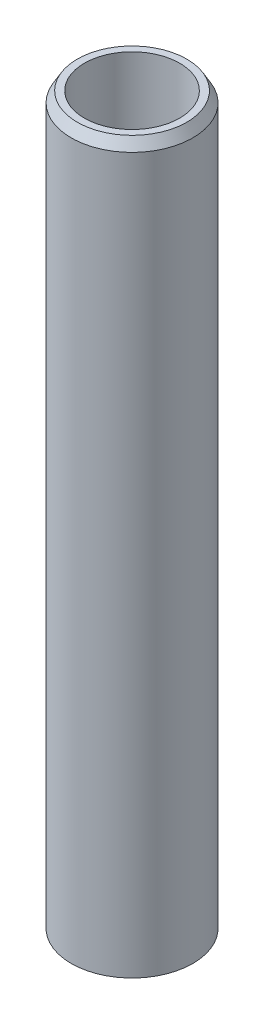
ISO-10303-21;
HEADER;
FILE_DESCRIPTION(('STEP AP214'),'2;1');
FILE_NAME('part.step','',(''),(''),'','','');
FILE_SCHEMA(('AUTOMOTIVE_DESIGN { 1 0 10303 214 1 1 1 1 }'));
ENDSEC;
DATA;
#1=APPLICATION_CONTEXT('core data for automotive mechanical design processes');
#2=APPLICATION_PROTOCOL_DEFINITION('international standard','automotive_design',2000,#1);
#3=PRODUCT_CONTEXT('',#1,'mechanical');
#4=PRODUCT('Part','Part','',(#3));
#5=PRODUCT_RELATED_PRODUCT_CATEGORY('part','',(#4));
#6=PRODUCT_DEFINITION_FORMATION('','',#4);
#7=PRODUCT_DEFINITION_CONTEXT('part definition',#1,'design');
#8=PRODUCT_DEFINITION('design','',#6,#7);
#9=PRODUCT_DEFINITION_SHAPE('','',#8);
#10=(LENGTH_UNIT() NAMED_UNIT(*) SI_UNIT(.MILLI.,.METRE.));
#11=(NAMED_UNIT(*) PLANE_ANGLE_UNIT() SI_UNIT($,.RADIAN.));
#12=(NAMED_UNIT(*) SI_UNIT($,.STERADIAN.) SOLID_ANGLE_UNIT());
#13=UNCERTAINTY_MEASURE_WITH_UNIT(LENGTH_MEASURE(1.E-05),#10,'distance_accuracy_value','');
#14=(GEOMETRIC_REPRESENTATION_CONTEXT(3) GLOBAL_UNCERTAINTY_ASSIGNED_CONTEXT((#13)) GLOBAL_UNIT_ASSIGNED_CONTEXT((#10,
#11,#12)) REPRESENTATION_CONTEXT('',''));
#15=CARTESIAN_POINT('',(0.,0.,0.));
#16=DIRECTION('',(0.,0.,1.));
#17=DIRECTION('',(1.,0.,0.));
#18=AXIS2_PLACEMENT_3D('',#15,#16,#17);
#19=CARTESIAN_POINT('',(0.,300.748974996906,0.));
#20=DIRECTION('',(0.,-1.,0.));
#21=DIRECTION('',(0.,0.,-1.));
#22=AXIS2_PLACEMENT_3D('',#19,#20,#21);
#23=CYLINDRICAL_SURFACE('',#22,25.);
#24=CARTESIAN_POINT('',(0.,296.434728667849,0.));
#25=DIRECTION('',(0.,1.,0.));
#26=DIRECTION('',(0.,0.,1.));
#27=AXIS2_PLACEMENT_3D('',#24,#25,#26);
#28=CIRCLE('',#27,25.);
#29=CARTESIAN_POINT('',(0.,296.434728667849,-25.));
#30=VERTEX_POINT('',#29);
#31=EDGE_CURVE('E50',#30,#30,#28,.F.);
#32=ORIENTED_EDGE('',*,*,#31,.T.);
#33=EDGE_LOOP('',(#32));
#34=FACE_BOUND('',#33,.T.);
#35=CARTESIAN_POINT('',(0.,2.49083127943167,0.));
#36=DIRECTION('',(0.,1.,0.));
#37=DIRECTION('',(0.,0.,1.));
#38=AXIS2_PLACEMENT_3D('',#35,#36,#37);
#39=CIRCLE('',#38,25.);
#40=CARTESIAN_POINT('',(0.,2.49083127943167,25.));
#41=VERTEX_POINT('',#40);
#42=EDGE_CURVE('E51',#41,#41,#39,.T.);
#43=ORIENTED_EDGE('',*,*,#42,.T.);
#44=EDGE_LOOP('',(#43));
#45=FACE_BOUND('',#44,.T.);
#46=ADVANCED_FACE('F39',(#34,#45),#23,.T.);
#47=CARTESIAN_POINT('',(0.,300.748974996906,0.));
#48=DIRECTION('',(0.,1.,0.));
#49=DIRECTION('',(0.,0.,1.));
#50=AXIS2_PLACEMENT_3D('',#47,#48,#49);
#51=PLANE('',#50);
#52=CARTESIAN_POINT('',(0.,300.748974996906,0.));
#53=DIRECTION('',(0.,1.,0.));
#54=DIRECTION('',(0.,0.,1.));
#55=AXIS2_PLACEMENT_3D('',#52,#53,#54);
#56=CIRCLE('',#55,22.5091687205683);
#57=CARTESIAN_POINT('',(0.,300.748974996906,-22.5091687205683));
#58=VERTEX_POINT('',#57);
#59=EDGE_CURVE('E54',#58,#58,#56,.T.);
#60=ORIENTED_EDGE('',*,*,#59,.T.);
#61=EDGE_LOOP('',(#60));
#62=FACE_BOUND('',#61,.T.);
#63=CARTESIAN_POINT('',(0.,300.748974996906,0.));
#64=DIRECTION('',(0.,1.,0.));
#65=DIRECTION('',(0.,0.,1.));
#66=AXIS2_PLACEMENT_3D('',#63,#64,#65);
#67=CIRCLE('',#66,19.5842731751092);
#68=CARTESIAN_POINT('',(0.,300.748974996906,19.5842731751092));
#69=VERTEX_POINT('',#68);
#70=EDGE_CURVE('E58',#69,#69,#67,.T.);
#71=ORIENTED_EDGE('',*,*,#70,.F.);
#72=EDGE_LOOP('',(#71));
#73=FACE_BOUND('',#72,.T.);
#74=ADVANCED_FACE('F69',(#62,#73),#51,.T.);
#75=CARTESIAN_POINT('',(0.,0.,0.));
#76=DIRECTION('',(0.,1.,0.));
#77=DIRECTION('',(0.,0.,1.));
#78=AXIS2_PLACEMENT_3D('',#75,#76,#77);
#79=PLANE('',#78);
#80=CARTESIAN_POINT('',(0.,0.,0.));
#81=DIRECTION('',(0.,1.,0.));
#82=DIRECTION('',(0.,0.,1.));
#83=AXIS2_PLACEMENT_3D('',#80,#81,#82);
#84=CIRCLE('',#83,20.6857536709426);
#85=CARTESIAN_POINT('',(0.,0.,20.6857536709426));
#86=VERTEX_POINT('',#85);
#87=EDGE_CURVE('E10',#86,#86,#84,.F.);
#88=ORIENTED_EDGE('',*,*,#87,.T.);
#89=EDGE_LOOP('',(#88));
#90=FACE_BOUND('',#89,.T.);
#91=CARTESIAN_POINT('',(0.,0.,0.));
#92=DIRECTION('',(0.,1.,0.));
#93=DIRECTION('',(0.,0.,1.));
#94=AXIS2_PLACEMENT_3D('',#91,#92,#93);
#95=CIRCLE('',#94,19.5842731751092);
#96=CARTESIAN_POINT('',(0.,0.,19.5842731751092));
#97=VERTEX_POINT('',#96);
#98=EDGE_CURVE('E63',#97,#97,#95,.T.);
#99=ORIENTED_EDGE('',*,*,#98,.T.);
#100=EDGE_LOOP('',(#99));
#101=FACE_BOUND('',#100,.T.);
#102=ADVANCED_FACE('F75',(#90,#101),#79,.F.);
#103=CARTESIAN_POINT('',(0.,300.748974996906,0.));
#104=DIRECTION('',(0.,-1.,0.));
#105=DIRECTION('',(0.,0.,-1.));
#106=AXIS2_PLACEMENT_3D('',#103,#104,#105);
#107=CYLINDRICAL_SURFACE('',#106,19.5842731751092);
#108=ORIENTED_EDGE('',*,*,#70,.T.);
#109=EDGE_LOOP('',(#108));
#110=FACE_BOUND('',#109,.T.);
#111=ORIENTED_EDGE('',*,*,#98,.F.);
#112=EDGE_LOOP('',(#111));
#113=FACE_BOUND('',#112,.T.);
#114=ADVANCED_FACE('F70',(#110,#113),#107,.F.);
#115=CARTESIAN_POINT('',(0.,300.748974996906,0.));
#116=DIRECTION('',(0.,-1.,0.));
#117=DIRECTION('',(0.,0.,-1.));
#118=AXIS2_PLACEMENT_3D('',#115,#116,#117);
#119=CONICAL_SURFACE('',#118,22.5091687205683,0.523598775598296);
#120=CARTESIAN_POINT('',(0.,296.434728667849,-25.));
#121=CARTESIAN_POINT('',(0.,296.479668733776,-24.9740538408393));
#122=CARTESIAN_POINT('',(0.,296.524608799704,-24.9481076816785));
#123=CARTESIAN_POINT('',(0.,296.61448893156,-24.896215363357));
#124=CARTESIAN_POINT('',(0.,296.659428997487,-24.8702692041963));
#125=CARTESIAN_POINT('',(0.,296.749309129343,-24.8183768858748));
#126=CARTESIAN_POINT('',(0.,296.79424919527,-24.792430726714));
#127=CARTESIAN_POINT('',(0.,296.884129327126,-24.7405384083925));
#128=CARTESIAN_POINT('',(0.,296.929069393053,-24.7145922492318));
#129=CARTESIAN_POINT('',(0.,297.018949524909,-24.6626999309103));
#130=CARTESIAN_POINT('',(0.,297.063889590836,-24.6367537717496));
#131=CARTESIAN_POINT('',(0.,297.153769722692,-24.5848614534281));
#132=CARTESIAN_POINT('',(0.,297.198709788619,-24.5589152942673));
#133=CARTESIAN_POINT('',(0.,297.288589920475,-24.5070229759458));
#134=CARTESIAN_POINT('',(0.,297.333529986402,-24.4810768167851));
#135=CARTESIAN_POINT('',(0.,297.423410118258,-24.4291844984636));
#136=CARTESIAN_POINT('',(0.,297.468350184186,-24.4032383393028));
#137=CARTESIAN_POINT('',(0.,297.558230316041,-24.3513460209813));
#138=CARTESIAN_POINT('',(0.,297.603170381969,-24.3253998618206));
#139=CARTESIAN_POINT('',(0.,297.693050513824,-24.2735075434991));
#140=CARTESIAN_POINT('',(0.,297.737990579752,-24.2475613843383));
#141=CARTESIAN_POINT('',(0.,297.827870711607,-24.1956690660169));
#142=CARTESIAN_POINT('',(0.,297.872810777535,-24.1697229068561));
#143=CARTESIAN_POINT('',(0.,297.96269090939,-24.1178305885346));
#144=CARTESIAN_POINT('',(0.,298.007630975318,-24.0918844293739));
#145=CARTESIAN_POINT('',(0.,298.097511107173,-24.0399921110524));
#146=CARTESIAN_POINT('',(0.,298.142451173101,-24.0140459518916));
#147=CARTESIAN_POINT('',(0.,298.232331304956,-23.9621536335701));
#148=CARTESIAN_POINT('',(0.,298.277271370884,-23.9362074744094));
#149=CARTESIAN_POINT('',(0.,298.367151502739,-23.8843151560879));
#150=CARTESIAN_POINT('',(0.,298.412091568667,-23.8583689969271));
#151=CARTESIAN_POINT('',(0.,298.501971700522,-23.8064766786056));
#152=CARTESIAN_POINT('',(0.,298.54691176645,-23.7805305194449));
#153=CARTESIAN_POINT('',(0.,298.636791898305,-23.7286382011234));
#154=CARTESIAN_POINT('',(0.,298.681731964233,-23.7026920419627));
#155=CARTESIAN_POINT('',(0.,298.771612096088,-23.6507997236412));
#156=CARTESIAN_POINT('',(0.,298.816552162016,-23.6248535644804));
#157=CARTESIAN_POINT('',(0.,298.906432293871,-23.5729612461589));
#158=CARTESIAN_POINT('',(0.,298.951372359799,-23.5470150869982));
#159=CARTESIAN_POINT('',(0.,299.041252491654,-23.4951227686767));
#160=CARTESIAN_POINT('',(0.,299.086192557582,-23.4691766095159));
#161=CARTESIAN_POINT('',(0.,299.176072689437,-23.4172842911944));
#162=CARTESIAN_POINT('',(0.,299.221012755365,-23.3913381320337));
#163=CARTESIAN_POINT('',(0.,299.310892887221,-23.3394458137122));
#164=CARTESIAN_POINT('',(0.,299.355832953148,-23.3134996545514));
#165=CARTESIAN_POINT('',(0.,299.445713085004,-23.26160733623));
#166=CARTESIAN_POINT('',(0.,299.490653150931,-23.2356611770692));
#167=CARTESIAN_POINT('',(0.,299.580533282787,-23.1837688587477));
#168=CARTESIAN_POINT('',(0.,299.625473348714,-23.157822699587));
#169=CARTESIAN_POINT('',(0.,299.71535348057,-23.1059303812655));
#170=CARTESIAN_POINT('',(0.,299.760293546497,-23.0799842221047));
#171=CARTESIAN_POINT('',(0.,299.850173678353,-23.0280919037832));
#172=CARTESIAN_POINT('',(0.,299.89511374428,-23.0021457446225));
#173=CARTESIAN_POINT('',(0.,299.984993876136,-22.950253426301));
#174=CARTESIAN_POINT('',(0.,300.029933942063,-22.9243072671402));
#175=CARTESIAN_POINT('',(0.,300.119814073919,-22.8724149488187));
#176=CARTESIAN_POINT('',(0.,300.164754139846,-22.846468789658));
#177=CARTESIAN_POINT('',(0.,300.254634271702,-22.7945764713365));
#178=CARTESIAN_POINT('',(0.,300.29957433763,-22.7686303121758));
#179=CARTESIAN_POINT('',(0.,300.389454469485,-22.7167379938543));
#180=CARTESIAN_POINT('',(0.,300.434394535413,-22.6907918346935));
#181=CARTESIAN_POINT('',(0.,300.524274667268,-22.638899516372));
#182=CARTESIAN_POINT('',(0.,300.569214733196,-22.6129533572113));
#183=CARTESIAN_POINT('',(0.,300.659094865051,-22.5610610388898));
#184=CARTESIAN_POINT('',(0.,300.704034930979,-22.535114879729));
#185=CARTESIAN_POINT('',(0.,300.748974996906,-22.5091687205683));
#186=B_SPLINE_CURVE_WITH_KNOTS('',3,(#120,#121,#122,#123,#124,#125,#126,#127,#128,#129,#130,
#131,#132,#133,#134,#135,#136,#137,#138,#139,#140,#141,#142,#143,#144,#145,#146,#147,#148,#149,
#150,#151,#152,#153,#154,#155,#156,#157,#158,#159,#160,#161,#162,#163,#164,#165,#166,#167,#168,
#169,#170,#171,#172,#173,#174,#175,#176,#177,#178,#179,#180,#181,#182,#183,#184,#185),
.UNSPECIFIED.,.F.,.F.,(4,2,2,2,2,2,2,2,2,2,2,2,2,2,2,2,2,2,2,2,2,2,2,2,2,2,2,2,2,2,2,2,4),(0.,
0.155676954964531,0.311353909929013,0.467030864893495,0.622707819857978,0.77838477482246,
0.934061729786945,1.08973868475143,1.24541563971591,1.40109259468039,1.55676954964487,
1.71244650460936,1.86812345957384,2.02380041453832,2.1794773695028,2.33515432446729,
2.49083127943177,2.64650823439625,2.80218518936073,2.95786214432522,3.1135390992897,
3.26921605425418,3.42489300921867,3.58056996418315,3.73624691914763,3.89192387411211,
4.0476008290766,4.20327778404108,4.35895473900556,4.51463169397004,4.67030864893452,
4.82598560389901,4.98166255886354),.UNSPECIFIED.);
#187=EDGE_CURVE('BSEAM81',#30,#58,#186,.T.);
#188=ORIENTED_EDGE('',*,*,#31,.F.);
#189=ORIENTED_EDGE('',*,*,#59,.F.);
#190=ORIENTED_EDGE('',*,*,#187,.T.);
#191=ORIENTED_EDGE('',*,*,#187,.F.);
#192=EDGE_LOOP('',(#188,#190,#189,#191));
#193=FACE_BOUND('',#192,.T.);
#194=ADVANCED_FACE('F81',(#193),#119,.T.);
#195=CARTESIAN_POINT('',(0.,2.49083127943167,0.));
#196=DIRECTION('',(0.,1.,0.));
#197=DIRECTION('',(0.,0.,1.));
#198=AXIS2_PLACEMENT_3D('',#195,#196,#197);
#199=CONICAL_SURFACE('',#198,25.,1.0471975511966);
#200=ORIENTED_EDGE('',*,*,#87,.F.);
#201=EDGE_LOOP('',(#200));
#202=FACE_BOUND('',#201,.T.);
#203=ORIENTED_EDGE('',*,*,#42,.F.);
#204=EDGE_LOOP('',(#203));
#205=FACE_BOUND('',#204,.T.);
#206=ADVANCED_FACE('F45',(#202,#205),#199,.T.);
#207=CLOSED_SHELL('',(#46,#74,#102,#114,#194,#206));
#208=MANIFOLD_SOLID_BREP('B2',#207);
#209=ADVANCED_BREP_SHAPE_REPRESENTATION('',(#18,#208),#14);
#210=SHAPE_DEFINITION_REPRESENTATION(#9,#209);
ENDSEC;
END-ISO-10303-21;
